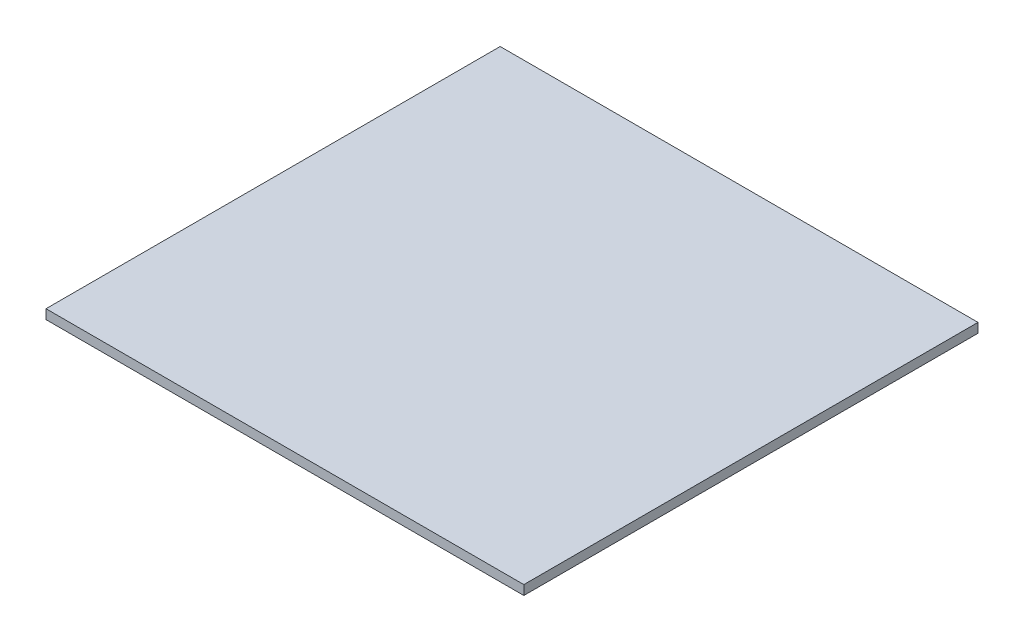
ISO-10303-21;
HEADER;
FILE_DESCRIPTION(('STEP AP214'),'2;1');
FILE_NAME('part.step','',(''),(''),'','','');
FILE_SCHEMA(('AUTOMOTIVE_DESIGN { 1 0 10303 214 1 1 1 1 }'));
ENDSEC;
DATA;
#1=APPLICATION_CONTEXT('core data for automotive mechanical design processes');
#2=APPLICATION_PROTOCOL_DEFINITION('international standard','automotive_design',2000,#1);
#3=PRODUCT_CONTEXT('',#1,'mechanical');
#4=PRODUCT('Part','Part','',(#3));
#5=PRODUCT_RELATED_PRODUCT_CATEGORY('part','',(#4));
#6=PRODUCT_DEFINITION_FORMATION('','',#4);
#7=PRODUCT_DEFINITION_CONTEXT('part definition',#1,'design');
#8=PRODUCT_DEFINITION('design','',#6,#7);
#9=PRODUCT_DEFINITION_SHAPE('','',#8);
#10=(LENGTH_UNIT() NAMED_UNIT(*) SI_UNIT(.MILLI.,.METRE.));
#11=(NAMED_UNIT(*) PLANE_ANGLE_UNIT() SI_UNIT($,.RADIAN.));
#12=(NAMED_UNIT(*) SI_UNIT($,.STERADIAN.) SOLID_ANGLE_UNIT());
#13=UNCERTAINTY_MEASURE_WITH_UNIT(LENGTH_MEASURE(1.E-05),#10,'distance_accuracy_value','');
#14=(GEOMETRIC_REPRESENTATION_CONTEXT(3) GLOBAL_UNCERTAINTY_ASSIGNED_CONTEXT((#13)) GLOBAL_UNIT_ASSIGNED_CONTEXT((#10,
#11,#12)) REPRESENTATION_CONTEXT('',''));
#15=CARTESIAN_POINT('',(0.,0.,0.));
#16=DIRECTION('',(0.,0.,1.));
#17=DIRECTION('',(1.,0.,0.));
#18=AXIS2_PLACEMENT_3D('',#15,#16,#17);
#19=CARTESIAN_POINT('',(-239.68530884808,10.,307.66875));
#20=DIRECTION('',(1.,0.,0.));
#21=DIRECTION('',(0.,0.,-1.));
#22=AXIS2_PLACEMENT_3D('',#19,#20,#21);
#23=PLANE('',#22);
#24=DIRECTION('',(0.,0.,1.));
#25=VECTOR('',#24,1.);
#26=CARTESIAN_POINT('',(-239.68530884808,0.,307.66875));
#27=LINE('',#26,#25);
#28=CARTESIAN_POINT('',(-239.68530884808,0.,-172.33125));
#29=VERTEX_POINT('',#28);
#30=CARTESIAN_POINT('',(-239.68530884808,0.,307.66875));
#31=VERTEX_POINT('',#30);
#32=EDGE_CURVE('E107',#29,#31,#27,.T.);
#33=ORIENTED_EDGE('',*,*,#32,.T.);
#34=DIRECTION('',(0.,-1.,0.));
#35=VECTOR('',#34,1.);
#36=CARTESIAN_POINT('',(-239.68530884808,10.,307.66875));
#37=LINE('',#36,#35);
#38=CARTESIAN_POINT('',(-239.68530884808,10.,307.66875));
#39=VERTEX_POINT('',#38);
#40=EDGE_CURVE('E11',#39,#31,#37,.T.);
#41=ORIENTED_EDGE('',*,*,#40,.F.);
#42=DIRECTION('',(0.,0.,1.));
#43=VECTOR('',#42,1.);
#44=CARTESIAN_POINT('',(-239.68530884808,10.,307.66875));
#45=LINE('',#44,#43);
#46=CARTESIAN_POINT('',(-239.68530884808,10.,-172.33125));
#47=VERTEX_POINT('',#46);
#48=EDGE_CURVE('E91',#47,#39,#45,.T.);
#49=ORIENTED_EDGE('',*,*,#48,.F.);
#50=DIRECTION('',(0.,-1.,0.));
#51=VECTOR('',#50,1.);
#52=CARTESIAN_POINT('',(-239.68530884808,10.,-172.33125));
#53=LINE('',#52,#51);
#54=EDGE_CURVE('E103',#47,#29,#53,.T.);
#55=ORIENTED_EDGE('',*,*,#54,.T.);
#56=EDGE_LOOP('',(#33,#41,#49,#55));
#57=FACE_BOUND('',#56,.T.);
#58=ADVANCED_FACE('F39',(#57),#23,.F.);
#59=CARTESIAN_POINT('',(265.31469115192,10.,307.66875));
#60=DIRECTION('',(0.,0.,-1.));
#61=DIRECTION('',(-1.,0.,0.));
#62=AXIS2_PLACEMENT_3D('',#59,#60,#61);
#63=PLANE('',#62);
#64=DIRECTION('',(1.,0.,0.));
#65=VECTOR('',#64,1.);
#66=CARTESIAN_POINT('',(265.31469115192,0.,307.66875));
#67=LINE('',#66,#65);
#68=CARTESIAN_POINT('',(265.31469115192,0.,307.66875));
#69=VERTEX_POINT('',#68);
#70=EDGE_CURVE('E96',#31,#69,#67,.T.);
#71=ORIENTED_EDGE('',*,*,#70,.T.);
#72=DIRECTION('',(0.,-1.,0.));
#73=VECTOR('',#72,1.);
#74=CARTESIAN_POINT('',(265.31469115192,10.,307.66875));
#75=LINE('',#74,#73);
#76=CARTESIAN_POINT('',(265.31469115192,10.,307.66875));
#77=VERTEX_POINT('',#76);
#78=EDGE_CURVE('E48',#77,#69,#75,.T.);
#79=ORIENTED_EDGE('',*,*,#78,.F.);
#80=DIRECTION('',(1.,0.,0.));
#81=VECTOR('',#80,1.);
#82=CARTESIAN_POINT('',(265.31469115192,10.,307.66875));
#83=LINE('',#82,#81);
#84=EDGE_CURVE('E86',#39,#77,#83,.T.);
#85=ORIENTED_EDGE('',*,*,#84,.F.);
#86=ORIENTED_EDGE('',*,*,#40,.T.);
#87=EDGE_LOOP('',(#71,#79,#85,#86));
#88=FACE_BOUND('',#87,.T.);
#89=ADVANCED_FACE('F95',(#88),#63,.F.);
#90=CARTESIAN_POINT('',(265.31469115192,10.,307.66875));
#91=DIRECTION('',(-1.,0.,0.));
#92=DIRECTION('',(0.,0.,1.));
#93=AXIS2_PLACEMENT_3D('',#90,#91,#92);
#94=PLANE('',#93);
#95=DIRECTION('',(0.,0.,-1.));
#96=VECTOR('',#95,1.);
#97=CARTESIAN_POINT('',(265.31469115192,0.,307.66875));
#98=LINE('',#97,#96);
#99=CARTESIAN_POINT('',(265.31469115192,0.,-172.33125));
#100=VERTEX_POINT('',#99);
#101=EDGE_CURVE('E73',#69,#100,#98,.T.);
#102=ORIENTED_EDGE('',*,*,#101,.T.);
#103=DIRECTION('',(0.,-1.,0.));
#104=VECTOR('',#103,1.);
#105=CARTESIAN_POINT('',(265.31469115192,10.,-172.33125));
#106=LINE('',#105,#104);
#107=CARTESIAN_POINT('',(265.31469115192,10.,-172.33125));
#108=VERTEX_POINT('',#107);
#109=EDGE_CURVE('E98',#108,#100,#106,.T.);
#110=ORIENTED_EDGE('',*,*,#109,.F.);
#111=DIRECTION('',(0.,0.,-1.));
#112=VECTOR('',#111,1.);
#113=CARTESIAN_POINT('',(265.31469115192,10.,307.66875));
#114=LINE('',#113,#112);
#115=EDGE_CURVE('E89',#77,#108,#114,.T.);
#116=ORIENTED_EDGE('',*,*,#115,.F.);
#117=ORIENTED_EDGE('',*,*,#78,.T.);
#118=EDGE_LOOP('',(#102,#110,#116,#117));
#119=FACE_BOUND('',#118,.T.);
#120=ADVANCED_FACE('F99',(#119),#94,.F.);
#121=CARTESIAN_POINT('',(265.31469115192,10.,-172.33125));
#122=DIRECTION('',(0.,0.,1.));
#123=DIRECTION('',(1.,0.,0.));
#124=AXIS2_PLACEMENT_3D('',#121,#122,#123);
#125=PLANE('',#124);
#126=DIRECTION('',(-1.,0.,0.));
#127=VECTOR('',#126,1.);
#128=CARTESIAN_POINT('',(265.31469115192,0.,-172.33125));
#129=LINE('',#128,#127);
#130=EDGE_CURVE('E79',#100,#29,#129,.T.);
#131=ORIENTED_EDGE('',*,*,#130,.T.);
#132=ORIENTED_EDGE('',*,*,#54,.F.);
#133=DIRECTION('',(-1.,0.,0.));
#134=VECTOR('',#133,1.);
#135=CARTESIAN_POINT('',(265.31469115192,10.,-172.33125));
#136=LINE('',#135,#134);
#137=EDGE_CURVE('E56',#108,#47,#136,.T.);
#138=ORIENTED_EDGE('',*,*,#137,.F.);
#139=ORIENTED_EDGE('',*,*,#109,.T.);
#140=EDGE_LOOP('',(#131,#132,#138,#139));
#141=FACE_BOUND('',#140,.T.);
#142=ADVANCED_FACE('F120',(#141),#125,.F.);
#143=CARTESIAN_POINT('',(0.,10.,0.));
#144=DIRECTION('',(0.,1.,0.));
#145=DIRECTION('',(0.,0.,1.));
#146=AXIS2_PLACEMENT_3D('',#143,#144,#145);
#147=PLANE('',#146);
#148=ORIENTED_EDGE('',*,*,#48,.T.);
#149=ORIENTED_EDGE('',*,*,#84,.T.);
#150=ORIENTED_EDGE('',*,*,#115,.T.);
#151=ORIENTED_EDGE('',*,*,#137,.T.);
#152=EDGE_LOOP('',(#148,#149,#150,#151));
#153=FACE_BOUND('',#152,.T.);
#154=ADVANCED_FACE('F87',(#153),#147,.T.);
#155=CARTESIAN_POINT('',(0.,0.,0.));
#156=DIRECTION('',(0.,1.,0.));
#157=DIRECTION('',(0.,0.,1.));
#158=AXIS2_PLACEMENT_3D('',#155,#156,#157);
#159=PLANE('',#158);
#160=ORIENTED_EDGE('',*,*,#32,.F.);
#161=ORIENTED_EDGE('',*,*,#130,.F.);
#162=ORIENTED_EDGE('',*,*,#101,.F.);
#163=ORIENTED_EDGE('',*,*,#70,.F.);
#164=EDGE_LOOP('',(#160,#161,#162,#163));
#165=FACE_BOUND('',#164,.T.);
#166=ADVANCED_FACE('F123',(#165),#159,.F.);
#167=CLOSED_SHELL('',(#58,#89,#120,#142,#154,#166));
#168=MANIFOLD_SOLID_BREP('B2',#167);
#169=ADVANCED_BREP_SHAPE_REPRESENTATION('',(#18,#168),#14);
#170=SHAPE_DEFINITION_REPRESENTATION(#9,#169);
ENDSEC;
END-ISO-10303-21;
